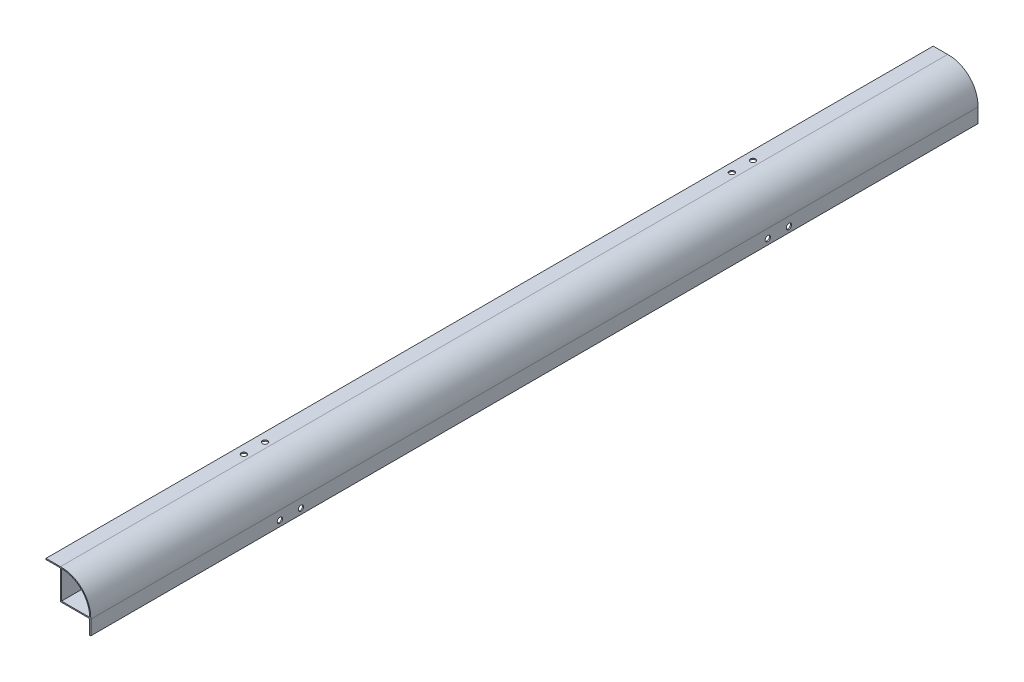
ISO-10303-21;
HEADER;
FILE_DESCRIPTION(('STEP AP214'),'2;1');
FILE_NAME('part.step','',(''),(''),'','','');
FILE_SCHEMA(('AUTOMOTIVE_DESIGN { 1 0 10303 214 1 1 1 1 }'));
ENDSEC;
DATA;
#1=APPLICATION_CONTEXT('core data for automotive mechanical design processes');
#2=APPLICATION_PROTOCOL_DEFINITION('international standard','automotive_design',2000,#1);
#3=PRODUCT_CONTEXT('',#1,'mechanical');
#4=PRODUCT('Part','Part','',(#3));
#5=PRODUCT_RELATED_PRODUCT_CATEGORY('part','',(#4));
#6=PRODUCT_DEFINITION_FORMATION('','',#4);
#7=PRODUCT_DEFINITION_CONTEXT('part definition',#1,'design');
#8=PRODUCT_DEFINITION('design','',#6,#7);
#9=PRODUCT_DEFINITION_SHAPE('','',#8);
#10=(LENGTH_UNIT() NAMED_UNIT(*) SI_UNIT(.MILLI.,.METRE.));
#11=(NAMED_UNIT(*) PLANE_ANGLE_UNIT() SI_UNIT($,.RADIAN.));
#12=(NAMED_UNIT(*) SI_UNIT($,.STERADIAN.) SOLID_ANGLE_UNIT());
#13=UNCERTAINTY_MEASURE_WITH_UNIT(LENGTH_MEASURE(1.E-05),#10,'distance_accuracy_value','');
#14=(GEOMETRIC_REPRESENTATION_CONTEXT(3) GLOBAL_UNCERTAINTY_ASSIGNED_CONTEXT((#13)) GLOBAL_UNIT_ASSIGNED_CONTEXT((#10,
#11,#12)) REPRESENTATION_CONTEXT('',''));
#15=CARTESIAN_POINT('',(0.,0.,0.));
#16=DIRECTION('',(0.,0.,1.));
#17=DIRECTION('',(1.,0.,0.));
#18=AXIS2_PLACEMENT_3D('',#15,#16,#17);
#19=CARTESIAN_POINT('',(12.6810538076097,0.,400.));
#20=DIRECTION('',(1.,0.,0.));
#21=DIRECTION('',(0.,1.,0.));
#22=AXIS2_PLACEMENT_3D('',#19,#20,#21);
#23=PLANE('',#22);
#24=CARTESIAN_POINT('',(12.6810538076097,-21.7,210.5));
#25=DIRECTION('',(1.,0.,0.));
#26=DIRECTION('',(0.,1.,0.));
#27=AXIS2_PLACEMENT_3D('',#24,#25,#26);
#28=CIRCLE('',#27,2.38125000000001);
#29=CARTESIAN_POINT('',(12.6810538076097,-19.31875,210.5));
#30=VERTEX_POINT('',#29);
#31=EDGE_CURVE('E504',#30,#30,#28,.T.);
#32=ORIENTED_EDGE('',*,*,#31,.T.);
#33=EDGE_LOOP('',(#32));
#34=FACE_BOUND('',#33,.T.);
#35=CARTESIAN_POINT('',(12.6810538076097,-21.6999999999999,-210.5));
#36=DIRECTION('',(1.,0.,0.));
#37=DIRECTION('',(0.,1.,0.));
#38=AXIS2_PLACEMENT_3D('',#35,#36,#37);
#39=CIRCLE('',#38,2.38125000000001);
#40=CARTESIAN_POINT('',(12.6810538076097,-19.3187499999999,-210.5));
#41=VERTEX_POINT('',#40);
#42=EDGE_CURVE('E509',#41,#41,#39,.F.);
#43=ORIENTED_EDGE('',*,*,#42,.F.);
#44=EDGE_LOOP('',(#43));
#45=FACE_BOUND('',#44,.T.);
#46=CARTESIAN_POINT('',(12.6810538076097,-21.6999999999999,-229.5));
#47=DIRECTION('',(1.,0.,0.));
#48=DIRECTION('',(0.,1.,0.));
#49=AXIS2_PLACEMENT_3D('',#46,#47,#48);
#50=CIRCLE('',#49,2.38125000000001);
#51=CARTESIAN_POINT('',(12.6810538076097,-19.3187499999999,-229.5));
#52=VERTEX_POINT('',#51);
#53=EDGE_CURVE('E530',#52,#52,#50,.F.);
#54=ORIENTED_EDGE('',*,*,#53,.F.);
#55=EDGE_LOOP('',(#54));
#56=FACE_BOUND('',#55,.T.);
#57=DIRECTION('',(0.,-1.,0.));
#58=VECTOR('',#57,1.);
#59=CARTESIAN_POINT('',(12.6810538076097,0.,-400.));
#60=LINE('',#59,#58);
#61=CARTESIAN_POINT('',(12.6810538076097,-13.7,-400.));
#62=VERTEX_POINT('',#61);
#63=CARTESIAN_POINT('',(12.6810538076097,-26.7,-400.));
#64=VERTEX_POINT('',#63);
#65=EDGE_CURVE('E215',#62,#64,#60,.T.);
#66=ORIENTED_EDGE('',*,*,#65,.T.);
#67=DIRECTION('',(0.,0.,-1.));
#68=VECTOR('',#67,1.);
#69=CARTESIAN_POINT('',(12.6810538076097,-26.7,400.));
#70=LINE('',#69,#68);
#71=CARTESIAN_POINT('',(12.6810538076097,-26.7,400.));
#72=VERTEX_POINT('',#71);
#73=EDGE_CURVE('E166',#72,#64,#70,.T.);
#74=ORIENTED_EDGE('',*,*,#73,.F.);
#75=DIRECTION('',(0.,-1.,0.));
#76=VECTOR('',#75,1.);
#77=CARTESIAN_POINT('',(12.6810538076097,0.,400.));
#78=LINE('',#77,#76);
#79=CARTESIAN_POINT('',(12.6810538076097,-13.7,400.));
#80=VERTEX_POINT('',#79);
#81=EDGE_CURVE('E232',#80,#72,#78,.T.);
#82=ORIENTED_EDGE('',*,*,#81,.F.);
#83=DIRECTION('',(0.,0.,-1.));
#84=VECTOR('',#83,1.);
#85=CARTESIAN_POINT('',(12.6810538076097,-13.7,400.));
#86=LINE('',#85,#84);
#87=EDGE_CURVE('E168',#80,#62,#86,.T.);
#88=ORIENTED_EDGE('',*,*,#87,.T.);
#89=EDGE_LOOP('',(#66,#74,#82,#88));
#90=FACE_BOUND('',#89,.T.);
#91=CARTESIAN_POINT('',(12.6810538076097,-21.7,229.5));
#92=DIRECTION('',(1.,0.,0.));
#93=DIRECTION('',(0.,1.,0.));
#94=AXIS2_PLACEMENT_3D('',#91,#92,#93);
#95=CIRCLE('',#94,2.38125000000001);
#96=CARTESIAN_POINT('',(12.6810538076097,-19.31875,229.5));
#97=VERTEX_POINT('',#96);
#98=EDGE_CURVE('E502',#97,#97,#95,.T.);
#99=ORIENTED_EDGE('',*,*,#98,.T.);
#100=EDGE_LOOP('',(#99));
#101=FACE_BOUND('',#100,.T.);
#102=ADVANCED_FACE('F36',(#34,#45,#56,#90,#101),#23,.F.);
#103=CARTESIAN_POINT('',(13.6810538076097,0.,400.));
#104=DIRECTION('',(1.,0.,0.));
#105=DIRECTION('',(0.,1.,0.));
#106=AXIS2_PLACEMENT_3D('',#103,#104,#105);
#107=PLANE('',#106);
#108=CARTESIAN_POINT('',(13.6810538076097,-21.6999999999999,-210.5));
#109=DIRECTION('',(1.,0.,0.));
#110=DIRECTION('',(0.,1.,0.));
#111=AXIS2_PLACEMENT_3D('',#108,#109,#110);
#112=CIRCLE('',#111,2.38125000000001);
#113=CARTESIAN_POINT('',(13.6810538076097,-19.3187499999999,-210.5));
#114=VERTEX_POINT('',#113);
#115=EDGE_CURVE('E536',#114,#114,#112,.F.);
#116=ORIENTED_EDGE('',*,*,#115,.T.);
#117=EDGE_LOOP('',(#116));
#118=FACE_BOUND('',#117,.T.);
#119=CARTESIAN_POINT('',(13.6810538076097,-21.6999999999999,-229.5));
#120=DIRECTION('',(1.,0.,0.));
#121=DIRECTION('',(0.,1.,0.));
#122=AXIS2_PLACEMENT_3D('',#119,#120,#121);
#123=CIRCLE('',#122,2.38125000000001);
#124=CARTESIAN_POINT('',(13.6810538076097,-19.3187499999999,-229.5));
#125=VERTEX_POINT('',#124);
#126=EDGE_CURVE('E533',#125,#125,#123,.F.);
#127=ORIENTED_EDGE('',*,*,#126,.T.);
#128=EDGE_LOOP('',(#127));
#129=FACE_BOUND('',#128,.T.);
#130=DIRECTION('',(0.,-1.,0.));
#131=VECTOR('',#130,1.);
#132=CARTESIAN_POINT('',(13.6810538076097,0.,-400.));
#133=LINE('',#132,#131);
#134=CARTESIAN_POINT('',(13.6810538076097,-13.7,-400.));
#135=VERTEX_POINT('',#134);
#136=CARTESIAN_POINT('',(13.6810538076097,-26.7,-400.));
#137=VERTEX_POINT('',#136);
#138=EDGE_CURVE('E149',#135,#137,#133,.T.);
#139=ORIENTED_EDGE('',*,*,#138,.F.);
#140=DIRECTION('',(0.,0.,-1.));
#141=VECTOR('',#140,1.);
#142=CARTESIAN_POINT('',(13.6810538076097,-13.7,400.));
#143=LINE('',#142,#141);
#144=CARTESIAN_POINT('',(13.6810538076097,-13.7,400.));
#145=VERTEX_POINT('',#144);
#146=EDGE_CURVE('E162',#145,#135,#143,.T.);
#147=ORIENTED_EDGE('',*,*,#146,.F.);
#148=DIRECTION('',(0.,-1.,0.));
#149=VECTOR('',#148,1.);
#150=CARTESIAN_POINT('',(13.6810538076097,0.,400.));
#151=LINE('',#150,#149);
#152=CARTESIAN_POINT('',(13.6810538076097,-26.7,400.));
#153=VERTEX_POINT('',#152);
#154=EDGE_CURVE('E142',#145,#153,#151,.T.);
#155=ORIENTED_EDGE('',*,*,#154,.T.);
#156=DIRECTION('',(0.,0.,-1.));
#157=VECTOR('',#156,1.);
#158=CARTESIAN_POINT('',(13.6810538076097,-26.7,400.));
#159=LINE('',#158,#157);
#160=EDGE_CURVE('E164',#153,#137,#159,.T.);
#161=ORIENTED_EDGE('',*,*,#160,.T.);
#162=EDGE_LOOP('',(#139,#147,#155,#161));
#163=FACE_BOUND('',#162,.T.);
#164=CARTESIAN_POINT('',(13.6810538076097,-21.7,210.5));
#165=DIRECTION('',(1.,0.,0.));
#166=DIRECTION('',(0.,1.,0.));
#167=AXIS2_PLACEMENT_3D('',#164,#165,#166);
#168=CIRCLE('',#167,2.38125000000001);
#169=CARTESIAN_POINT('',(13.6810538076097,-19.31875,210.5));
#170=VERTEX_POINT('',#169);
#171=EDGE_CURVE('E539',#170,#170,#168,.T.);
#172=ORIENTED_EDGE('',*,*,#171,.F.);
#173=EDGE_LOOP('',(#172));
#174=FACE_BOUND('',#173,.T.);
#175=CARTESIAN_POINT('',(13.6810538076097,-21.7,229.5));
#176=DIRECTION('',(1.,0.,0.));
#177=DIRECTION('',(0.,1.,0.));
#178=AXIS2_PLACEMENT_3D('',#175,#176,#177);
#179=CIRCLE('',#178,2.38125000000001);
#180=CARTESIAN_POINT('',(13.6810538076097,-19.31875,229.5));
#181=VERTEX_POINT('',#180);
#182=EDGE_CURVE('E499',#181,#181,#179,.T.);
#183=ORIENTED_EDGE('',*,*,#182,.F.);
#184=EDGE_LOOP('',(#183));
#185=FACE_BOUND('',#184,.T.);
#186=ADVANCED_FACE('F275',(#118,#129,#163,#174,#185),#107,.T.);
#187=CARTESIAN_POINT('',(-12.7,0.,400.));
#188=DIRECTION('',(-1.,0.,0.));
#189=DIRECTION('',(0.,-1.,0.));
#190=AXIS2_PLACEMENT_3D('',#187,#188,#189);
#191=PLANE('',#190);
#192=DIRECTION('',(0.,1.,0.));
#193=VECTOR('',#192,1.);
#194=CARTESIAN_POINT('',(-12.7,0.,-400.));
#195=LINE('',#194,#193);
#196=CARTESIAN_POINT('',(-12.7,-12.7,-400.));
#197=VERTEX_POINT('',#196);
#198=CARTESIAN_POINT('',(-12.7,12.7,-400.));
#199=VERTEX_POINT('',#198);
#200=EDGE_CURVE('E145',#197,#199,#195,.T.);
#201=ORIENTED_EDGE('',*,*,#200,.T.);
#202=DIRECTION('',(0.,0.,-1.));
#203=VECTOR('',#202,1.);
#204=CARTESIAN_POINT('',(-12.7,12.7,400.));
#205=LINE('',#204,#203);
#206=CARTESIAN_POINT('',(-12.7,12.7,400.));
#207=VERTEX_POINT('',#206);
#208=EDGE_CURVE('E11',#207,#199,#205,.T.);
#209=ORIENTED_EDGE('',*,*,#208,.F.);
#210=DIRECTION('',(0.,1.,0.));
#211=VECTOR('',#210,1.);
#212=CARTESIAN_POINT('',(-12.7,0.,400.));
#213=LINE('',#212,#211);
#214=CARTESIAN_POINT('',(-12.7,-12.7,400.));
#215=VERTEX_POINT('',#214);
#216=EDGE_CURVE('E139',#215,#207,#213,.T.);
#217=ORIENTED_EDGE('',*,*,#216,.F.);
#218=DIRECTION('',(0.,0.,-1.));
#219=VECTOR('',#218,1.);
#220=CARTESIAN_POINT('',(-12.7,-12.7,400.));
#221=LINE('',#220,#219);
#222=EDGE_CURVE('E55',#215,#197,#221,.T.);
#223=ORIENTED_EDGE('',*,*,#222,.T.);
#224=EDGE_LOOP('',(#201,#209,#217,#223));
#225=FACE_BOUND('',#224,.T.);
#226=ADVANCED_FACE('F144',(#225),#191,.F.);
#227=CARTESIAN_POINT('',(-12.7,-12.7,400.));
#228=DIRECTION('',(0.,0.,-1.));
#229=DIRECTION('',(-1.,0.,0.));
#230=AXIS2_PLACEMENT_3D('',#227,#228,#229);
#231=CYLINDRICAL_SURFACE('',#230,25.4);
#232=CARTESIAN_POINT('',(-12.7,-12.7,-400.));
#233=DIRECTION('',(0.,0.,1.));
#234=DIRECTION('',(1.,0.,0.));
#235=AXIS2_PLACEMENT_3D('',#232,#233,#234);
#236=CIRCLE('',#235,25.4);
#237=CARTESIAN_POINT('',(12.7,-12.7,-400.));
#238=VERTEX_POINT('',#237);
#239=EDGE_CURVE('E148',#199,#238,#236,.F.);
#240=ORIENTED_EDGE('',*,*,#239,.T.);
#241=DIRECTION('',(0.,0.,-1.));
#242=VECTOR('',#241,1.);
#243=CARTESIAN_POINT('',(12.7,-12.7,400.));
#244=LINE('',#243,#242);
#245=CARTESIAN_POINT('',(12.7,-12.7,400.));
#246=VERTEX_POINT('',#245);
#247=EDGE_CURVE('E46',#246,#238,#244,.T.);
#248=ORIENTED_EDGE('',*,*,#247,.F.);
#249=CARTESIAN_POINT('',(-12.7,-12.7,400.));
#250=DIRECTION('',(0.,0.,1.));
#251=DIRECTION('',(1.,0.,0.));
#252=AXIS2_PLACEMENT_3D('',#249,#250,#251);
#253=CIRCLE('',#252,25.4);
#254=EDGE_CURVE('E132',#207,#246,#253,.F.);
#255=ORIENTED_EDGE('',*,*,#254,.F.);
#256=ORIENTED_EDGE('',*,*,#208,.T.);
#257=EDGE_LOOP('',(#240,#248,#255,#256));
#258=FACE_BOUND('',#257,.T.);
#259=ADVANCED_FACE('F134',(#258),#231,.F.);
#260=CARTESIAN_POINT('',(-12.7,-12.7,400.));
#261=DIRECTION('',(0.,0.,-1.));
#262=DIRECTION('',(-1.,0.,0.));
#263=AXIS2_PLACEMENT_3D('',#260,#261,#262);
#264=CYLINDRICAL_SURFACE('',#263,26.4);
#265=CARTESIAN_POINT('',(-12.7,-12.7,-400.));
#266=DIRECTION('',(0.,0.,1.));
#267=DIRECTION('',(1.,0.,0.));
#268=AXIS2_PLACEMENT_3D('',#265,#266,#267);
#269=CIRCLE('',#268,26.4);
#270=CARTESIAN_POINT('',(-13.7,13.6810538076097,-400.));
#271=VERTEX_POINT('',#270);
#272=EDGE_CURVE('E192',#271,#135,#269,.F.);
#273=ORIENTED_EDGE('',*,*,#272,.F.);
#274=DIRECTION('',(0.,0.,-1.));
#275=VECTOR('',#274,1.);
#276=CARTESIAN_POINT('',(-13.7,13.6810538076097,400.));
#277=LINE('',#276,#275);
#278=CARTESIAN_POINT('',(-13.7,13.6810538076097,400.));
#279=VERTEX_POINT('',#278);
#280=EDGE_CURVE('E105',#279,#271,#277,.T.);
#281=ORIENTED_EDGE('',*,*,#280,.F.);
#282=CARTESIAN_POINT('',(-12.7,-12.7,400.));
#283=DIRECTION('',(0.,0.,1.));
#284=DIRECTION('',(1.,0.,0.));
#285=AXIS2_PLACEMENT_3D('',#282,#283,#284);
#286=CIRCLE('',#285,26.4);
#287=EDGE_CURVE('E159',#279,#145,#286,.F.);
#288=ORIENTED_EDGE('',*,*,#287,.T.);
#289=ORIENTED_EDGE('',*,*,#146,.T.);
#290=EDGE_LOOP('',(#273,#281,#288,#289));
#291=FACE_BOUND('',#290,.T.);
#292=ADVANCED_FACE('F38',(#291),#264,.T.);
#293=CARTESIAN_POINT('',(0.,13.6810538076097,400.));
#294=DIRECTION('',(0.,-1.,0.));
#295=DIRECTION('',(1.,0.,0.));
#296=AXIS2_PLACEMENT_3D('',#293,#294,#295);
#297=PLANE('',#296);
#298=CARTESIAN_POINT('',(-18.7,13.6810538076097,229.5));
#299=DIRECTION('',(0.,1.,0.));
#300=DIRECTION('',(-1.,0.,0.));
#301=AXIS2_PLACEMENT_3D('',#298,#299,#300);
#302=CIRCLE('',#301,2.38125000000006);
#303=CARTESIAN_POINT('',(-21.0812500000001,13.6810538076097,229.5));
#304=VERTEX_POINT('',#303);
#305=EDGE_CURVE('E513',#304,#304,#302,.T.);
#306=ORIENTED_EDGE('',*,*,#305,.F.);
#307=EDGE_LOOP('',(#306));
#308=FACE_BOUND('',#307,.T.);
#309=CARTESIAN_POINT('',(-18.7,13.6810538076097,-229.5));
#310=DIRECTION('',(0.,1.,0.));
#311=DIRECTION('',(1.,0.,0.));
#312=AXIS2_PLACEMENT_3D('',#309,#310,#311);
#313=CIRCLE('',#312,2.38125000000006);
#314=CARTESIAN_POINT('',(-16.31875,13.6810538076097,-229.5));
#315=VERTEX_POINT('',#314);
#316=EDGE_CURVE('E507',#315,#315,#313,.T.);
#317=ORIENTED_EDGE('',*,*,#316,.F.);
#318=EDGE_LOOP('',(#317));
#319=FACE_BOUND('',#318,.T.);
#320=CARTESIAN_POINT('',(-18.7,13.6810538076097,-210.5));
#321=DIRECTION('',(0.,1.,0.));
#322=DIRECTION('',(1.,0.,0.));
#323=AXIS2_PLACEMENT_3D('',#320,#321,#322);
#324=CIRCLE('',#323,2.38125000000006);
#325=CARTESIAN_POINT('',(-16.31875,13.6810538076097,-210.5));
#326=VERTEX_POINT('',#325);
#327=EDGE_CURVE('E503',#326,#326,#324,.T.);
#328=ORIENTED_EDGE('',*,*,#327,.F.);
#329=EDGE_LOOP('',(#328));
#330=FACE_BOUND('',#329,.T.);
#331=CARTESIAN_POINT('',(-18.7,13.6810538076097,210.5));
#332=DIRECTION('',(0.,1.,0.));
#333=DIRECTION('',(-1.,0.,0.));
#334=AXIS2_PLACEMENT_3D('',#331,#332,#333);
#335=CIRCLE('',#334,2.38125000000006);
#336=CARTESIAN_POINT('',(-21.0812500000001,13.6810538076097,210.5));
#337=VERTEX_POINT('',#336);
#338=EDGE_CURVE('E185',#337,#337,#335,.T.);
#339=ORIENTED_EDGE('',*,*,#338,.F.);
#340=EDGE_LOOP('',(#339));
#341=FACE_BOUND('',#340,.T.);
#342=DIRECTION('',(-1.,0.,0.));
#343=VECTOR('',#342,1.);
#344=CARTESIAN_POINT('',(0.,13.6810538076097,-400.));
#345=LINE('',#344,#343);
#346=CARTESIAN_POINT('',(-26.7,13.6810538076097,-400.));
#347=VERTEX_POINT('',#346);
#348=EDGE_CURVE('E196',#271,#347,#345,.T.);
#349=ORIENTED_EDGE('',*,*,#348,.T.);
#350=DIRECTION('',(0.,0.,-1.));
#351=VECTOR('',#350,1.);
#352=CARTESIAN_POINT('',(-26.7,13.6810538076097,400.));
#353=LINE('',#352,#351);
#354=CARTESIAN_POINT('',(-26.7,13.6810538076097,400.));
#355=VERTEX_POINT('',#354);
#356=EDGE_CURVE('E177',#355,#347,#353,.T.);
#357=ORIENTED_EDGE('',*,*,#356,.F.);
#358=DIRECTION('',(-1.,0.,0.));
#359=VECTOR('',#358,1.);
#360=CARTESIAN_POINT('',(0.,13.6810538076097,400.));
#361=LINE('',#360,#359);
#362=EDGE_CURVE('E257',#279,#355,#361,.T.);
#363=ORIENTED_EDGE('',*,*,#362,.F.);
#364=ORIENTED_EDGE('',*,*,#280,.T.);
#365=EDGE_LOOP('',(#349,#357,#363,#364));
#366=FACE_BOUND('',#365,.T.);
#367=ADVANCED_FACE('F256',(#308,#319,#330,#341,#366),#297,.F.);
#368=CARTESIAN_POINT('',(-26.7,0.,400.));
#369=DIRECTION('',(1.,0.,0.));
#370=DIRECTION('',(0.,0.,-1.));
#371=AXIS2_PLACEMENT_3D('',#368,#369,#370);
#372=PLANE('',#371);
#373=DIRECTION('',(0.,-1.,0.));
#374=VECTOR('',#373,1.);
#375=CARTESIAN_POINT('',(-26.7,0.,-400.));
#376=LINE('',#375,#374);
#377=CARTESIAN_POINT('',(-26.7,12.6810538076097,-400.));
#378=VERTEX_POINT('',#377);
#379=EDGE_CURVE('E201',#347,#378,#376,.T.);
#380=ORIENTED_EDGE('',*,*,#379,.T.);
#381=DIRECTION('',(0.,0.,-1.));
#382=VECTOR('',#381,1.);
#383=CARTESIAN_POINT('',(-26.7,12.6810538076097,400.));
#384=LINE('',#383,#382);
#385=CARTESIAN_POINT('',(-26.7,12.6810538076097,400.));
#386=VERTEX_POINT('',#385);
#387=EDGE_CURVE('E175',#386,#378,#384,.T.);
#388=ORIENTED_EDGE('',*,*,#387,.F.);
#389=DIRECTION('',(0.,-1.,0.));
#390=VECTOR('',#389,1.);
#391=CARTESIAN_POINT('',(-26.7,0.,400.));
#392=LINE('',#391,#390);
#393=EDGE_CURVE('E254',#355,#386,#392,.T.);
#394=ORIENTED_EDGE('',*,*,#393,.F.);
#395=ORIENTED_EDGE('',*,*,#356,.T.);
#396=EDGE_LOOP('',(#380,#388,#394,#395));
#397=FACE_BOUND('',#396,.T.);
#398=ADVANCED_FACE('F251',(#397),#372,.F.);
#399=CARTESIAN_POINT('',(0.,12.6810538076097,400.));
#400=DIRECTION('',(0.,-1.,0.));
#401=DIRECTION('',(1.,0.,0.));
#402=AXIS2_PLACEMENT_3D('',#399,#400,#401);
#403=PLANE('',#402);
#404=CARTESIAN_POINT('',(-18.7,12.6810538076097,229.5));
#405=DIRECTION('',(0.,-1.,0.));
#406=DIRECTION('',(1.,0.,0.));
#407=AXIS2_PLACEMENT_3D('',#404,#405,#406);
#408=CIRCLE('',#407,2.38125000000006);
#409=CARTESIAN_POINT('',(-16.3187499999999,12.6810538076097,229.5));
#410=VERTEX_POINT('',#409);
#411=EDGE_CURVE('E40',#410,#410,#408,.T.);
#412=ORIENTED_EDGE('',*,*,#411,.F.);
#413=EDGE_LOOP('',(#412));
#414=FACE_BOUND('',#413,.T.);
#415=CARTESIAN_POINT('',(-18.7,12.6810538076097,-229.5));
#416=DIRECTION('',(0.,-1.,0.));
#417=DIRECTION('',(1.,0.,0.));
#418=AXIS2_PLACEMENT_3D('',#415,#416,#417);
#419=CIRCLE('',#418,2.38125000000006);
#420=CARTESIAN_POINT('',(-16.31875,12.6810538076097,-229.5));
#421=VERTEX_POINT('',#420);
#422=EDGE_CURVE('E187',#421,#421,#419,.T.);
#423=ORIENTED_EDGE('',*,*,#422,.F.);
#424=EDGE_LOOP('',(#423));
#425=FACE_BOUND('',#424,.T.);
#426=CARTESIAN_POINT('',(-18.7,12.6810538076097,-210.5));
#427=DIRECTION('',(0.,-1.,0.));
#428=DIRECTION('',(1.,0.,0.));
#429=AXIS2_PLACEMENT_3D('',#426,#427,#428);
#430=CIRCLE('',#429,2.38125000000006);
#431=CARTESIAN_POINT('',(-16.31875,12.6810538076097,-210.5));
#432=VERTEX_POINT('',#431);
#433=EDGE_CURVE('E184',#432,#432,#430,.T.);
#434=ORIENTED_EDGE('',*,*,#433,.F.);
#435=EDGE_LOOP('',(#434));
#436=FACE_BOUND('',#435,.T.);
#437=CARTESIAN_POINT('',(-18.7,12.6810538076097,210.5));
#438=DIRECTION('',(0.,-1.,0.));
#439=DIRECTION('',(1.,0.,0.));
#440=AXIS2_PLACEMENT_3D('',#437,#438,#439);
#441=CIRCLE('',#440,2.38125000000006);
#442=CARTESIAN_POINT('',(-16.3187499999999,12.6810538076097,210.5));
#443=VERTEX_POINT('',#442);
#444=EDGE_CURVE('E181',#443,#443,#441,.T.);
#445=ORIENTED_EDGE('',*,*,#444,.F.);
#446=EDGE_LOOP('',(#445));
#447=FACE_BOUND('',#446,.T.);
#448=DIRECTION('',(-1.,0.,0.));
#449=VECTOR('',#448,1.);
#450=CARTESIAN_POINT('',(0.,12.6810538076097,-400.));
#451=LINE('',#450,#449);
#452=CARTESIAN_POINT('',(-13.7,12.6810538076097,-400.));
#453=VERTEX_POINT('',#452);
#454=EDGE_CURVE('E207',#453,#378,#451,.T.);
#455=ORIENTED_EDGE('',*,*,#454,.F.);
#456=DIRECTION('',(0.,0.,-1.));
#457=VECTOR('',#456,1.);
#458=CARTESIAN_POINT('',(-13.7,12.6810538076097,400.));
#459=LINE('',#458,#457);
#460=CARTESIAN_POINT('',(-13.7,12.6810538076097,400.));
#461=VERTEX_POINT('',#460);
#462=EDGE_CURVE('E173',#461,#453,#459,.T.);
#463=ORIENTED_EDGE('',*,*,#462,.F.);
#464=DIRECTION('',(-1.,0.,0.));
#465=VECTOR('',#464,1.);
#466=CARTESIAN_POINT('',(0.,12.6810538076097,400.));
#467=LINE('',#466,#465);
#468=EDGE_CURVE('E268',#461,#386,#467,.T.);
#469=ORIENTED_EDGE('',*,*,#468,.T.);
#470=ORIENTED_EDGE('',*,*,#387,.T.);
#471=EDGE_LOOP('',(#455,#463,#469,#470));
#472=FACE_BOUND('',#471,.T.);
#473=ADVANCED_FACE('F247',(#414,#425,#436,#447,#472),#403,.T.);
#474=CARTESIAN_POINT('',(-13.7,0.,400.));
#475=DIRECTION('',(-1.,0.,0.));
#476=DIRECTION('',(0.,-1.,0.));
#477=AXIS2_PLACEMENT_3D('',#474,#475,#476);
#478=PLANE('',#477);
#479=DIRECTION('',(0.,1.,0.));
#480=VECTOR('',#479,1.);
#481=CARTESIAN_POINT('',(-13.7,0.,-400.));
#482=LINE('',#481,#480);
#483=CARTESIAN_POINT('',(-13.7,-13.7,-400.));
#484=VERTEX_POINT('',#483);
#485=EDGE_CURVE('E210',#484,#453,#482,.T.);
#486=ORIENTED_EDGE('',*,*,#485,.F.);
#487=DIRECTION('',(0.,0.,-1.));
#488=VECTOR('',#487,1.);
#489=CARTESIAN_POINT('',(-13.7,-13.7,400.));
#490=LINE('',#489,#488);
#491=CARTESIAN_POINT('',(-13.7,-13.7,400.));
#492=VERTEX_POINT('',#491);
#493=EDGE_CURVE('E171',#492,#484,#490,.T.);
#494=ORIENTED_EDGE('',*,*,#493,.F.);
#495=DIRECTION('',(0.,1.,0.));
#496=VECTOR('',#495,1.);
#497=CARTESIAN_POINT('',(-13.7,0.,400.));
#498=LINE('',#497,#496);
#499=EDGE_CURVE('E243',#492,#461,#498,.T.);
#500=ORIENTED_EDGE('',*,*,#499,.T.);
#501=ORIENTED_EDGE('',*,*,#462,.T.);
#502=EDGE_LOOP('',(#486,#494,#500,#501));
#503=FACE_BOUND('',#502,.T.);
#504=ADVANCED_FACE('F240',(#503),#478,.T.);
#505=CARTESIAN_POINT('',(0.,-13.7,400.));
#506=DIRECTION('',(0.,1.,0.));
#507=DIRECTION('',(0.,0.,1.));
#508=AXIS2_PLACEMENT_3D('',#505,#506,#507);
#509=PLANE('',#508);
#510=DIRECTION('',(1.,0.,0.));
#511=VECTOR('',#510,1.);
#512=CARTESIAN_POINT('',(0.,-13.7,-400.));
#513=LINE('',#512,#511);
#514=EDGE_CURVE('E213',#484,#62,#513,.T.);
#515=ORIENTED_EDGE('',*,*,#514,.T.);
#516=ORIENTED_EDGE('',*,*,#87,.F.);
#517=DIRECTION('',(1.,0.,0.));
#518=VECTOR('',#517,1.);
#519=CARTESIAN_POINT('',(0.,-13.7,400.));
#520=LINE('',#519,#518);
#521=EDGE_CURVE('E236',#492,#80,#520,.T.);
#522=ORIENTED_EDGE('',*,*,#521,.F.);
#523=ORIENTED_EDGE('',*,*,#493,.T.);
#524=EDGE_LOOP('',(#515,#516,#522,#523));
#525=FACE_BOUND('',#524,.T.);
#526=ADVANCED_FACE('F235',(#525),#509,.F.);
#527=CARTESIAN_POINT('',(0.,-26.7,400.));
#528=DIRECTION('',(0.,-1.,0.));
#529=DIRECTION('',(0.,0.,-1.));
#530=AXIS2_PLACEMENT_3D('',#527,#528,#529);
#531=PLANE('',#530);
#532=DIRECTION('',(-1.,0.,0.));
#533=VECTOR('',#532,1.);
#534=CARTESIAN_POINT('',(0.,-26.7,-400.));
#535=LINE('',#534,#533);
#536=EDGE_CURVE('E154',#137,#64,#535,.T.);
#537=ORIENTED_EDGE('',*,*,#536,.F.);
#538=ORIENTED_EDGE('',*,*,#160,.F.);
#539=DIRECTION('',(-1.,0.,0.));
#540=VECTOR('',#539,1.);
#541=CARTESIAN_POINT('',(0.,-26.7,400.));
#542=LINE('',#541,#540);
#543=EDGE_CURVE('E227',#153,#72,#542,.T.);
#544=ORIENTED_EDGE('',*,*,#543,.T.);
#545=ORIENTED_EDGE('',*,*,#73,.T.);
#546=EDGE_LOOP('',(#537,#538,#544,#545));
#547=FACE_BOUND('',#546,.T.);
#548=ADVANCED_FACE('F223',(#547),#531,.T.);
#549=CARTESIAN_POINT('',(0.,-12.7,400.));
#550=DIRECTION('',(0.,1.,0.));
#551=DIRECTION('',(-1.,0.,0.));
#552=AXIS2_PLACEMENT_3D('',#549,#550,#551);
#553=PLANE('',#552);
#554=DIRECTION('',(1.,0.,0.));
#555=VECTOR('',#554,1.);
#556=CARTESIAN_POINT('',(0.,-12.7,-400.));
#557=LINE('',#556,#555);
#558=EDGE_CURVE('E151',#197,#238,#557,.T.);
#559=ORIENTED_EDGE('',*,*,#558,.F.);
#560=ORIENTED_EDGE('',*,*,#222,.F.);
#561=DIRECTION('',(1.,0.,0.));
#562=VECTOR('',#561,1.);
#563=CARTESIAN_POINT('',(0.,-12.7,400.));
#564=LINE('',#563,#562);
#565=EDGE_CURVE('E138',#215,#246,#564,.T.);
#566=ORIENTED_EDGE('',*,*,#565,.T.);
#567=ORIENTED_EDGE('',*,*,#247,.T.);
#568=EDGE_LOOP('',(#559,#560,#566,#567));
#569=FACE_BOUND('',#568,.T.);
#570=ADVANCED_FACE('F327',(#569),#553,.T.);
#571=CARTESIAN_POINT('',(0.,0.,400.));
#572=DIRECTION('',(0.,0.,1.));
#573=DIRECTION('',(1.,0.,0.));
#574=AXIS2_PLACEMENT_3D('',#571,#572,#573);
#575=PLANE('',#574);
#576=ORIENTED_EDGE('',*,*,#287,.F.);
#577=ORIENTED_EDGE('',*,*,#362,.T.);
#578=ORIENTED_EDGE('',*,*,#393,.T.);
#579=ORIENTED_EDGE('',*,*,#468,.F.);
#580=ORIENTED_EDGE('',*,*,#499,.F.);
#581=ORIENTED_EDGE('',*,*,#521,.T.);
#582=ORIENTED_EDGE('',*,*,#81,.T.);
#583=ORIENTED_EDGE('',*,*,#543,.F.);
#584=ORIENTED_EDGE('',*,*,#154,.F.);
#585=EDGE_LOOP('',(#576,#577,#578,#579,#580,#581,#582,#583,#584));
#586=FACE_BOUND('',#585,.T.);
#587=ORIENTED_EDGE('',*,*,#216,.T.);
#588=ORIENTED_EDGE('',*,*,#254,.T.);
#589=ORIENTED_EDGE('',*,*,#565,.F.);
#590=EDGE_LOOP('',(#587,#588,#589));
#591=FACE_BOUND('',#590,.T.);
#592=ADVANCED_FACE('F141',(#586,#591),#575,.T.);
#593=CARTESIAN_POINT('',(0.,0.,-400.));
#594=DIRECTION('',(0.,0.,1.));
#595=DIRECTION('',(1.,0.,0.));
#596=AXIS2_PLACEMENT_3D('',#593,#594,#595);
#597=PLANE('',#596);
#598=ORIENTED_EDGE('',*,*,#272,.T.);
#599=ORIENTED_EDGE('',*,*,#138,.T.);
#600=ORIENTED_EDGE('',*,*,#536,.T.);
#601=ORIENTED_EDGE('',*,*,#65,.F.);
#602=ORIENTED_EDGE('',*,*,#514,.F.);
#603=ORIENTED_EDGE('',*,*,#485,.T.);
#604=ORIENTED_EDGE('',*,*,#454,.T.);
#605=ORIENTED_EDGE('',*,*,#379,.F.);
#606=ORIENTED_EDGE('',*,*,#348,.F.);
#607=EDGE_LOOP('',(#598,#599,#600,#601,#602,#603,#604,#605,#606));
#608=FACE_BOUND('',#607,.T.);
#609=ORIENTED_EDGE('',*,*,#200,.F.);
#610=ORIENTED_EDGE('',*,*,#558,.T.);
#611=ORIENTED_EDGE('',*,*,#239,.F.);
#612=EDGE_LOOP('',(#609,#610,#611));
#613=FACE_BOUND('',#612,.T.);
#614=ADVANCED_FACE('F220',(#608,#613),#597,.F.);
#615=CARTESIAN_POINT('',(-18.7,3.68105380760973,210.5));
#616=DIRECTION('',(0.,1.,0.));
#617=DIRECTION('',(-1.,0.,0.));
#618=AXIS2_PLACEMENT_3D('',#615,#616,#617);
#619=CYLINDRICAL_SURFACE('',#618,2.38125000000006);
#620=ORIENTED_EDGE('',*,*,#444,.T.);
#621=EDGE_LOOP('',(#620));
#622=FACE_BOUND('',#621,.T.);
#623=ORIENTED_EDGE('',*,*,#338,.T.);
#624=EDGE_LOOP('',(#623));
#625=FACE_BOUND('',#624,.T.);
#626=ADVANCED_FACE('F345',(#622,#625),#619,.F.);
#627=CARTESIAN_POINT('',(-18.7,3.68105380760973,-210.5));
#628=DIRECTION('',(0.,1.,0.));
#629=DIRECTION('',(-1.,0.,0.));
#630=AXIS2_PLACEMENT_3D('',#627,#628,#629);
#631=CYLINDRICAL_SURFACE('',#630,2.38125000000006);
#632=ORIENTED_EDGE('',*,*,#433,.T.);
#633=EDGE_LOOP('',(#632));
#634=FACE_BOUND('',#633,.T.);
#635=ORIENTED_EDGE('',*,*,#327,.T.);
#636=EDGE_LOOP('',(#635));
#637=FACE_BOUND('',#636,.T.);
#638=ADVANCED_FACE('F351',(#634,#637),#631,.F.);
#639=CARTESIAN_POINT('',(-18.7,3.68105380760973,-229.5));
#640=DIRECTION('',(0.,1.,0.));
#641=DIRECTION('',(-1.,0.,0.));
#642=AXIS2_PLACEMENT_3D('',#639,#640,#641);
#643=CYLINDRICAL_SURFACE('',#642,2.38125000000006);
#644=ORIENTED_EDGE('',*,*,#422,.T.);
#645=EDGE_LOOP('',(#644));
#646=FACE_BOUND('',#645,.T.);
#647=ORIENTED_EDGE('',*,*,#316,.T.);
#648=EDGE_LOOP('',(#647));
#649=FACE_BOUND('',#648,.T.);
#650=ADVANCED_FACE('F359',(#646,#649),#643,.F.);
#651=CARTESIAN_POINT('',(-18.7,3.68105380760973,229.5));
#652=DIRECTION('',(0.,1.,0.));
#653=DIRECTION('',(-1.,0.,0.));
#654=AXIS2_PLACEMENT_3D('',#651,#652,#653);
#655=CYLINDRICAL_SURFACE('',#654,2.38125000000006);
#656=ORIENTED_EDGE('',*,*,#411,.T.);
#657=EDGE_LOOP('',(#656));
#658=FACE_BOUND('',#657,.T.);
#659=ORIENTED_EDGE('',*,*,#305,.T.);
#660=EDGE_LOOP('',(#659));
#661=FACE_BOUND('',#660,.T.);
#662=ADVANCED_FACE('F367',(#658,#661),#655,.F.);
#663=CARTESIAN_POINT('',(3.68105380760974,-21.6999999999999,-229.5));
#664=DIRECTION('',(1.,0.,0.));
#665=DIRECTION('',(0.,1.,0.));
#666=AXIS2_PLACEMENT_3D('',#663,#664,#665);
#667=CYLINDRICAL_SURFACE('',#666,2.38125000000001);
#668=ORIENTED_EDGE('',*,*,#126,.F.);
#669=EDGE_LOOP('',(#668));
#670=FACE_BOUND('',#669,.T.);
#671=ORIENTED_EDGE('',*,*,#53,.T.);
#672=EDGE_LOOP('',(#671));
#673=FACE_BOUND('',#672,.T.);
#674=ADVANCED_FACE('F374',(#670,#673),#667,.F.);
#675=CARTESIAN_POINT('',(3.68105380760974,-21.6999999999999,-210.5));
#676=DIRECTION('',(1.,0.,0.));
#677=DIRECTION('',(0.,1.,0.));
#678=AXIS2_PLACEMENT_3D('',#675,#676,#677);
#679=CYLINDRICAL_SURFACE('',#678,2.38125000000001);
#680=ORIENTED_EDGE('',*,*,#115,.F.);
#681=EDGE_LOOP('',(#680));
#682=FACE_BOUND('',#681,.T.);
#683=ORIENTED_EDGE('',*,*,#42,.T.);
#684=EDGE_LOOP('',(#683));
#685=FACE_BOUND('',#684,.T.);
#686=ADVANCED_FACE('F381',(#682,#685),#679,.F.);
#687=CARTESIAN_POINT('',(3.68105380760974,-21.7,210.5));
#688=DIRECTION('',(1.,0.,0.));
#689=DIRECTION('',(0.,1.,0.));
#690=AXIS2_PLACEMENT_3D('',#687,#688,#689);
#691=CYLINDRICAL_SURFACE('',#690,2.38125000000001);
#692=ORIENTED_EDGE('',*,*,#171,.T.);
#693=EDGE_LOOP('',(#692));
#694=FACE_BOUND('',#693,.T.);
#695=ORIENTED_EDGE('',*,*,#31,.F.);
#696=EDGE_LOOP('',(#695));
#697=FACE_BOUND('',#696,.T.);
#698=ADVANCED_FACE('F390',(#694,#697),#691,.F.);
#699=CARTESIAN_POINT('',(3.68105380760974,-21.7,229.5));
#700=DIRECTION('',(1.,0.,0.));
#701=DIRECTION('',(0.,1.,0.));
#702=AXIS2_PLACEMENT_3D('',#699,#700,#701);
#703=CYLINDRICAL_SURFACE('',#702,2.38125000000001);
#704=ORIENTED_EDGE('',*,*,#182,.T.);
#705=EDGE_LOOP('',(#704));
#706=FACE_BOUND('',#705,.T.);
#707=ORIENTED_EDGE('',*,*,#98,.F.);
#708=EDGE_LOOP('',(#707));
#709=FACE_BOUND('',#708,.T.);
#710=ADVANCED_FACE('F398',(#706,#709),#703,.F.);
#711=CLOSED_SHELL('',(#102,#186,#226,#259,#292,#367,#398,#473,#504,#526,#548,#570,#592,#614,
#626,#638,#650,#662,#674,#686,#698,#710));
#712=MANIFOLD_SOLID_BREP('B2',#711);
#713=ADVANCED_BREP_SHAPE_REPRESENTATION('',(#18,#712),#14);
#714=SHAPE_DEFINITION_REPRESENTATION(#9,#713);
ENDSEC;
END-ISO-10303-21;
